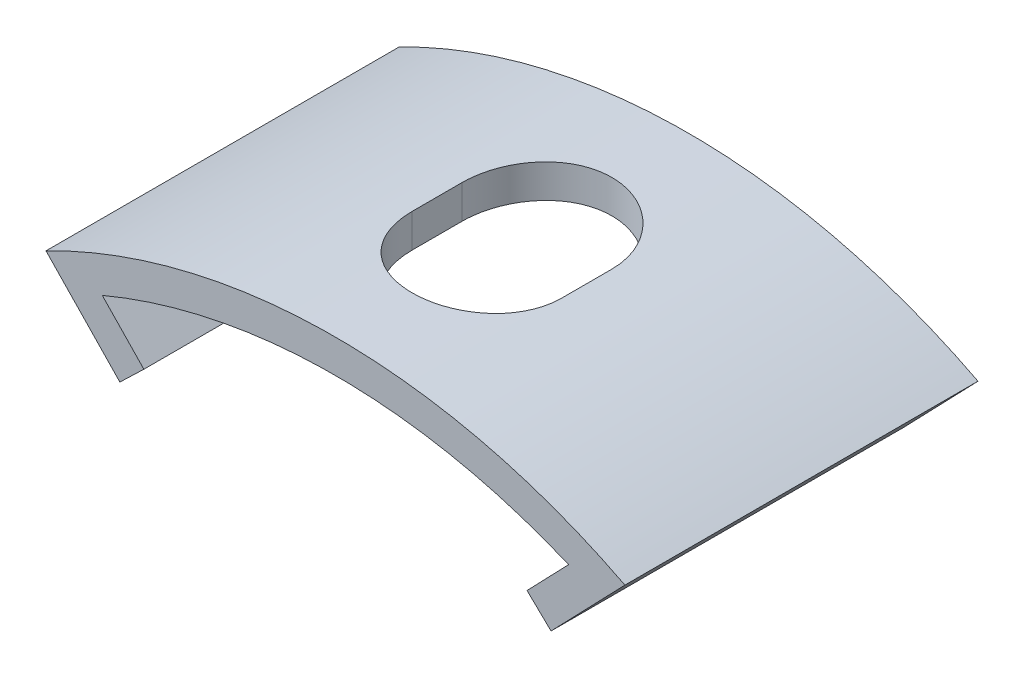
ISO-10303-21;
HEADER;
FILE_DESCRIPTION(('STEP AP214'),'2;1');
FILE_NAME('part.step','',(''),(''),'','','');
FILE_SCHEMA(('AUTOMOTIVE_DESIGN { 1 0 10303 214 1 1 1 1 }'));
ENDSEC;
DATA;
#1=APPLICATION_CONTEXT('core data for automotive mechanical design processes');
#2=APPLICATION_PROTOCOL_DEFINITION('international standard','automotive_design',2000,#1);
#3=PRODUCT_CONTEXT('',#1,'mechanical');
#4=PRODUCT('Part','Part','',(#3));
#5=PRODUCT_RELATED_PRODUCT_CATEGORY('part','',(#4));
#6=PRODUCT_DEFINITION_FORMATION('','',#4);
#7=PRODUCT_DEFINITION_CONTEXT('part definition',#1,'design');
#8=PRODUCT_DEFINITION('design','',#6,#7);
#9=PRODUCT_DEFINITION_SHAPE('','',#8);
#10=(LENGTH_UNIT() NAMED_UNIT(*) SI_UNIT(.MILLI.,.METRE.));
#11=(NAMED_UNIT(*) PLANE_ANGLE_UNIT() SI_UNIT($,.RADIAN.));
#12=(NAMED_UNIT(*) SI_UNIT($,.STERADIAN.) SOLID_ANGLE_UNIT());
#13=UNCERTAINTY_MEASURE_WITH_UNIT(LENGTH_MEASURE(1.E-05),#10,'distance_accuracy_value','');
#14=(GEOMETRIC_REPRESENTATION_CONTEXT(3) GLOBAL_UNCERTAINTY_ASSIGNED_CONTEXT((#13)) GLOBAL_UNIT_ASSIGNED_CONTEXT((#10,
#11,#12)) REPRESENTATION_CONTEXT('',''));
#15=CARTESIAN_POINT('',(0.,0.,0.));
#16=DIRECTION('',(0.,0.,1.));
#17=DIRECTION('',(1.,0.,0.));
#18=AXIS2_PLACEMENT_3D('',#15,#16,#17);
#19=CARTESIAN_POINT('',(0.,0.,5.3));
#20=DIRECTION('',(0.,0.,-1.));
#21=DIRECTION('',(-1.,0.,0.));
#22=AXIS2_PLACEMENT_3D('',#19,#20,#21);
#23=CYLINDRICAL_SURFACE('',#22,18.);
#24=CARTESIAN_POINT('',(0.,0.,-5.3));
#25=DIRECTION('',(0.,0.,1.));
#26=DIRECTION('',(1.,0.,0.));
#27=AXIS2_PLACEMENT_3D('',#24,#25,#26);
#28=CIRCLE('',#27,18.);
#29=CARTESIAN_POINT('',(7.,16.583123951777,-5.3));
#30=VERTEX_POINT('',#29);
#31=CARTESIAN_POINT('',(-7.,16.583123951777,-5.3));
#32=VERTEX_POINT('',#31);
#33=EDGE_CURVE('E229',#30,#32,#28,.T.);
#34=ORIENTED_EDGE('',*,*,#33,.F.);
#35=DIRECTION('',(0.,0.,-1.));
#36=VECTOR('',#35,1.);
#37=CARTESIAN_POINT('',(7.,16.583123951777,5.3));
#38=LINE('',#37,#36);
#39=CARTESIAN_POINT('',(7.,16.583123951777,5.3));
#40=VERTEX_POINT('',#39);
#41=EDGE_CURVE('E250',#40,#30,#38,.T.);
#42=ORIENTED_EDGE('',*,*,#41,.F.);
#43=CARTESIAN_POINT('',(0.,0.,5.3));
#44=DIRECTION('',(0.,0.,1.));
#45=DIRECTION('',(1.,0.,0.));
#46=AXIS2_PLACEMENT_3D('',#43,#44,#45);
#47=CIRCLE('',#46,18.);
#48=CARTESIAN_POINT('',(-7.,16.583123951777,5.3));
#49=VERTEX_POINT('',#48);
#50=EDGE_CURVE('E264',#40,#49,#47,.T.);
#51=ORIENTED_EDGE('',*,*,#50,.T.);
#52=DIRECTION('',(0.,0.,-1.));
#53=VECTOR('',#52,1.);
#54=CARTESIAN_POINT('',(-7.,16.583123951777,5.3));
#55=LINE('',#54,#53);
#56=EDGE_CURVE('E252',#49,#32,#55,.T.);
#57=ORIENTED_EDGE('',*,*,#56,.T.);
#58=EDGE_LOOP('',(#34,#42,#51,#57));
#59=FACE_BOUND('',#58,.T.);
#60=DIRECTION('',(0.,0.,-1.));
#61=VECTOR('',#60,1.);
#62=CARTESIAN_POINT('',(-2.25,17.858821349686,5.3));
#63=LINE('',#62,#61);
#64=CARTESIAN_POINT('',(-2.25,17.858821349686,-0.75));
#65=VERTEX_POINT('',#64);
#66=CARTESIAN_POINT('',(-2.25,17.858821349686,0.75));
#67=VERTEX_POINT('',#66);
#68=EDGE_CURVE('E177',#65,#67,#63,.F.);
#69=ORIENTED_EDGE('',*,*,#68,.T.);
#70=CARTESIAN_POINT('',(-2.25,17.858821349686,0.75));
#71=CARTESIAN_POINT('',(-2.24999987433453,17.8588194251762,0.813038421910983));
#72=CARTESIAN_POINT('',(-2.24734910280741,17.8591555464734,0.876046400447922));
#73=CARTESIAN_POINT('',(-2.2367760280738,17.860483614898,1.00160662816571));
#74=CARTESIAN_POINT('',(-2.22885413082701,17.8614755115204,1.06415891206719));
#75=CARTESIAN_POINT('',(-2.19726613729562,17.8653995354746,1.25031674039511));
#76=CARTESIAN_POINT('',(-2.16577747401027,17.8692801491553,1.37266760263013));
#77=CARTESIAN_POINT('',(-2.08284998220627,17.8791347069465,1.61029050708662));
#78=CARTESIAN_POINT('',(-2.03140462668968,17.8851093358599,1.72556021905842));
#79=CARTESIAN_POINT('',(-1.9100445468626,17.8984759849888,1.94583988541639));
#80=CARTESIAN_POINT('',(-1.8401312637343,17.9058678945916,2.0508506395056));
#81=CARTESIAN_POINT('',(-1.68341206734406,17.9212816202412,2.24819255503716));
#82=CARTESIAN_POINT('',(-1.59652505875848,17.9293063453518,2.34045906512173));
#83=CARTESIAN_POINT('',(-1.4084881592424,17.9450563047993,2.50915218989586));
#84=CARTESIAN_POINT('',(-1.30733609827826,17.9527814933416,2.58557639023872));
#85=CARTESIAN_POINT('',(-1.09323565451996,17.9670912133723,2.72063635035758));
#86=CARTESIAN_POINT('',(-0.980249611183446,17.9736719143119,2.77921284845707));
#87=CARTESIAN_POINT('',(-0.745954846626403,17.9849184109182,2.87653235189302));
#88=CARTESIAN_POINT('',(-0.624646927843693,17.98958439091,2.9152772664524));
#89=CARTESIAN_POINT('',(-0.377817617303712,17.9964554763961,2.97164252706326));
#90=CARTESIAN_POINT('',(-0.252321524361256,17.9986733000917,2.98937208399253));
#91=CARTESIAN_POINT('',(-0.000113958053788392,18.0004416380206,3.00354192890028));
#92=CARTESIAN_POINT('',(0.126597496892533,17.9999921926125,2.9999825390033));
#93=CARTESIAN_POINT('',(0.376889084753837,17.996486825208,2.97176228226685));
#94=CARTESIAN_POINT('',(0.500482760825345,17.9934454852649,2.94721946613686));
#95=CARTESIAN_POINT('',(0.741782589261214,17.9851144748259,2.87791368788275));
#96=CARTESIAN_POINT('',(0.859488661703709,17.9798247738188,2.83315045135721));
#97=CARTESIAN_POINT('',(1.08604033017171,17.9675661901284,2.72454804183679));
#98=CARTESIAN_POINT('',(1.19486100591024,17.9605927880744,2.66065741466114));
#99=CARTESIAN_POINT('',(1.40027581309508,17.9457473888532,2.51565390113486));
#100=CARTESIAN_POINT('',(1.49686990014344,17.9378753884233,2.43454095224834));
#101=CARTESIAN_POINT('',(1.67577600776006,17.9220509715218,2.25674697940169));
#102=CARTESIAN_POINT('',(1.75798787566357,17.9140983698413,2.15996517270914));
#103=CARTESIAN_POINT('',(1.90504051240019,17.8990587520914,1.95388697055325));
#104=CARTESIAN_POINT('',(1.96987611791605,17.8919719936451,1.84458686904738));
#105=CARTESIAN_POINT('',(2.08034030367041,17.8794655923308,1.61647074802186));
#106=CARTESIAN_POINT('',(2.12594942241975,17.8740476401532,1.49764523072224));
#107=CARTESIAN_POINT('',(2.19647134414845,17.8655197697751,1.25402518960859));
#108=CARTESIAN_POINT('',(2.22141531410094,17.8624063766198,1.12923995593975));
#109=CARTESIAN_POINT('',(2.24045955676342,17.860021010604,0.961297341119165));
#110=CARTESIAN_POINT('',(2.24403891993201,17.8595714574598,0.919080958189035));
#111=CARTESIAN_POINT('',(2.24880594188023,17.8589719767877,0.834582343684646));
#112=CARTESIAN_POINT('',(2.2499976086946,17.8588215471485,0.792300341894064));
#113=CARTESIAN_POINT('',(2.25,17.858821349686,0.75));
#114=B_SPLINE_CURVE_WITH_KNOTS('',3,(#70,#71,#72,#73,#74,#75,#76,#77,#78,#79,#80,#81,#82,#83,
#84,#85,#86,#87,#88,#89,#90,#91,#92,#93,#94,#95,#96,#97,#98,#99,#100,#101,#102,#103,#104,#105,
#106,#107,#108,#109,#110,#111,#112,#113),.UNSPECIFIED.,.F.,.F.,(4,2,2,2,2,2,2,2,2,2,2,2,2,2,2,2,
2,2,2,2,2,4),(0.,0.188998328147948,0.377982102132345,0.755226013918386,1.13259341054784,
1.50993136724195,1.88911828117894,2.2683629402761,2.6488534582724,3.02930733885574,
3.40777531688837,3.78623756831039,4.16258453387273,4.53893660680898,4.91631033520017,
5.29368543389454,5.6735920154572,6.05361136055525,6.43401445159375,6.81384277259916,
6.94090357256708,7.06775090645285),.UNSPECIFIED.);
#115=CARTESIAN_POINT('',(2.25,17.858821349686,0.75));
#116=VERTEX_POINT('',#115);
#117=EDGE_CURVE('E142',#67,#116,#114,.T.);
#118=ORIENTED_EDGE('',*,*,#117,.T.);
#119=DIRECTION('',(0.,0.,-1.));
#120=VECTOR('',#119,1.);
#121=CARTESIAN_POINT('',(2.25,17.858821349686,5.3));
#122=LINE('',#121,#120);
#123=CARTESIAN_POINT('',(2.25,17.858821349686,-0.75));
#124=VERTEX_POINT('',#123);
#125=EDGE_CURVE('E176',#116,#124,#122,.T.);
#126=ORIENTED_EDGE('',*,*,#125,.T.);
#127=CARTESIAN_POINT('',(2.25,17.858821349686,-0.75));
#128=CARTESIAN_POINT('',(2.24999987433453,17.8588194251762,-0.813038421910983));
#129=CARTESIAN_POINT('',(2.24734910280741,17.8591555464734,-0.876046400447922));
#130=CARTESIAN_POINT('',(2.2367760280738,17.860483614898,-1.00160662816571));
#131=CARTESIAN_POINT('',(2.22885413082701,17.8614755115204,-1.06415891206719));
#132=CARTESIAN_POINT('',(2.19726613729562,17.8653995354746,-1.25031674039511));
#133=CARTESIAN_POINT('',(2.16577747401027,17.8692801491553,-1.37266760263013));
#134=CARTESIAN_POINT('',(2.08284998220627,17.8791347069465,-1.61029050708662));
#135=CARTESIAN_POINT('',(2.03140462668968,17.8851093358599,-1.72556021905842));
#136=CARTESIAN_POINT('',(1.91004454686259,17.8984759849888,-1.94583988541639));
#137=CARTESIAN_POINT('',(1.8401312637343,17.9058678945916,-2.0508506395056));
#138=CARTESIAN_POINT('',(1.68341206734406,17.9212816202412,-2.24819255503716));
#139=CARTESIAN_POINT('',(1.59652505875848,17.9293063453518,-2.34045906512173));
#140=CARTESIAN_POINT('',(1.4084881592424,17.9450563047993,-2.50915218989586));
#141=CARTESIAN_POINT('',(1.30733609827826,17.9527814933416,-2.58557639023872));
#142=CARTESIAN_POINT('',(1.09323565451996,17.9670912133723,-2.72063635035758));
#143=CARTESIAN_POINT('',(0.980249611183446,17.9736719143119,-2.77921284845707));
#144=CARTESIAN_POINT('',(0.745954846626401,17.9849184109182,-2.87653235189302));
#145=CARTESIAN_POINT('',(0.624646927843692,17.98958439091,-2.9152772664524));
#146=CARTESIAN_POINT('',(0.377817617303711,17.9964554763961,-2.97164252706327));
#147=CARTESIAN_POINT('',(0.252321524361255,17.9986733000917,-2.98937208399253));
#148=CARTESIAN_POINT('',(0.000113958053786956,18.0004416380206,-3.00354192890028));
#149=CARTESIAN_POINT('',(-0.126597496892535,17.9999921926125,-2.9999825390033));
#150=CARTESIAN_POINT('',(-0.376889084753838,17.996486825208,-2.97176228226685));
#151=CARTESIAN_POINT('',(-0.500482760825348,17.9934454852649,-2.94721946613686));
#152=CARTESIAN_POINT('',(-0.741782589261217,17.9851144748259,-2.87791368788275));
#153=CARTESIAN_POINT('',(-0.859488661703711,17.9798247738188,-2.83315045135721));
#154=CARTESIAN_POINT('',(-1.08604033017171,17.9675661901284,-2.72454804183679));
#155=CARTESIAN_POINT('',(-1.19486100591024,17.9605927880744,-2.66065741466114));
#156=CARTESIAN_POINT('',(-1.40027581309508,17.9457473888532,-2.51565390113486));
#157=CARTESIAN_POINT('',(-1.49686990014345,17.9378753884233,-2.43454095224834));
#158=CARTESIAN_POINT('',(-1.67577600776006,17.9220509715218,-2.25674697940169));
#159=CARTESIAN_POINT('',(-1.75798787566357,17.9140983698413,-2.15996517270914));
#160=CARTESIAN_POINT('',(-1.90504051240019,17.8990587520914,-1.95388697055325));
#161=CARTESIAN_POINT('',(-1.96987611791605,17.8919719936451,-1.84458686904739));
#162=CARTESIAN_POINT('',(-2.08034030367041,17.8794655923308,-1.61647074802187));
#163=CARTESIAN_POINT('',(-2.12594942241975,17.8740476401532,-1.49764523072224));
#164=CARTESIAN_POINT('',(-2.19647134414845,17.8655197697751,-1.25402518960859));
#165=CARTESIAN_POINT('',(-2.22141531410094,17.8624063766198,-1.12923995593975));
#166=CARTESIAN_POINT('',(-2.24045955676343,17.860021010604,-0.961297341119165));
#167=CARTESIAN_POINT('',(-2.24403891993201,17.8595714574598,-0.919080958189035));
#168=CARTESIAN_POINT('',(-2.24880594188023,17.8589719767877,-0.834582343684645));
#169=CARTESIAN_POINT('',(-2.24999760869461,17.8588215471485,-0.792300341894064));
#170=CARTESIAN_POINT('',(-2.25,17.858821349686,-0.749999999999999));
#171=B_SPLINE_CURVE_WITH_KNOTS('',3,(#127,#128,#129,#130,#131,#132,#133,#134,#135,#136,#137,
#138,#139,#140,#141,#142,#143,#144,#145,#146,#147,#148,#149,#150,#151,#152,#153,#154,#155,#156,
#157,#158,#159,#160,#161,#162,#163,#164,#165,#166,#167,#168,#169,#170),.UNSPECIFIED.,.F.,.F.,(4,
2,2,2,2,2,2,2,2,2,2,2,2,2,2,2,2,2,2,2,2,4),(0.,0.188998328147948,0.377982102132345,
0.755226013918386,1.13259341054784,1.50993136724195,1.88911828117894,2.2683629402761,
2.6488534582724,3.02930733885574,3.40777531688837,3.78623756831039,4.16258453387273,
4.53893660680899,4.91631033520017,5.29368543389454,5.6735920154572,6.05361136055525,
6.43401445159375,6.81384277259917,6.94090357256708,7.06775090645286),.UNSPECIFIED.);
#172=EDGE_CURVE('E168',#124,#65,#171,.T.);
#173=ORIENTED_EDGE('',*,*,#172,.T.);
#174=EDGE_LOOP('',(#69,#118,#126,#173));
#175=FACE_BOUND('',#174,.T.);
#176=ADVANCED_FACE('F39',(#59,#175),#23,.F.);
#177=CARTESIAN_POINT('',(0.,0.,5.3));
#178=DIRECTION('',(0.,0.,-1.));
#179=DIRECTION('',(-1.,0.,0.));
#180=AXIS2_PLACEMENT_3D('',#177,#178,#179);
#181=CYLINDRICAL_SURFACE('',#180,19.);
#182=CARTESIAN_POINT('',(0.,0.,-5.3));
#183=DIRECTION('',(0.,0.,1.));
#184=DIRECTION('',(1.,0.,0.));
#185=AXIS2_PLACEMENT_3D('',#182,#183,#184);
#186=CIRCLE('',#185,19.);
#187=CARTESIAN_POINT('',(8.68969024076547,16.896428129032,-5.3));
#188=VERTEX_POINT('',#187);
#189=CARTESIAN_POINT('',(-8.68969024076547,16.896428129032,-5.3));
#190=VERTEX_POINT('',#189);
#191=EDGE_CURVE('E214',#188,#190,#186,.T.);
#192=ORIENTED_EDGE('',*,*,#191,.T.);
#193=DIRECTION('',(0.,0.,-1.));
#194=VECTOR('',#193,1.);
#195=CARTESIAN_POINT('',(-8.68969024076547,16.896428129032,5.3));
#196=LINE('',#195,#194);
#197=CARTESIAN_POINT('',(-8.68969024076547,16.896428129032,5.3));
#198=VERTEX_POINT('',#197);
#199=EDGE_CURVE('E241',#198,#190,#196,.T.);
#200=ORIENTED_EDGE('',*,*,#199,.F.);
#201=CARTESIAN_POINT('',(0.,0.,5.3));
#202=DIRECTION('',(0.,0.,1.));
#203=DIRECTION('',(1.,0.,0.));
#204=AXIS2_PLACEMENT_3D('',#201,#202,#203);
#205=CIRCLE('',#204,19.);
#206=CARTESIAN_POINT('',(8.68969024076547,16.896428129032,5.3));
#207=VERTEX_POINT('',#206);
#208=EDGE_CURVE('E225',#207,#198,#205,.T.);
#209=ORIENTED_EDGE('',*,*,#208,.F.);
#210=DIRECTION('',(0.,0.,-1.));
#211=VECTOR('',#210,1.);
#212=CARTESIAN_POINT('',(8.68969024076547,16.896428129032,5.3));
#213=LINE('',#212,#211);
#214=EDGE_CURVE('E243',#207,#188,#213,.T.);
#215=ORIENTED_EDGE('',*,*,#214,.T.);
#216=EDGE_LOOP('',(#192,#200,#209,#215));
#217=FACE_BOUND('',#216,.T.);
#218=CARTESIAN_POINT('',(-2.25,18.8663059447259,0.75));
#219=CARTESIAN_POINT('',(-2.24999984413377,18.866304126766,0.813065444008957));
#220=CARTESIAN_POINT('',(-2.24734683038286,18.8666225662772,0.876100456864434));
#221=CARTESIAN_POINT('',(-2.23676461239271,18.8678808036718,1.00171506453087));
#222=CARTESIAN_POINT('',(-2.22883579857183,18.8688205555769,1.06429469269468));
#223=CARTESIAN_POINT('',(-2.19721906511498,18.8725384514377,1.25053881791379));
#224=CARTESIAN_POINT('',(-2.16570059497972,18.876215376971,1.37294884829296));
#225=CARTESIAN_POINT('',(-2.08268940200505,18.8855534165936,1.61068939978139));
#226=CARTESIAN_POINT('',(-2.0311898629049,18.8912152077282,1.72601748941873));
#227=CARTESIAN_POINT('',(-1.9096974928355,18.9038824486064,1.94640209506089));
#228=CARTESIAN_POINT('',(-1.83970632808281,18.9108877772729,2.05145953535055));
#229=CARTESIAN_POINT('',(-1.68285058840054,18.9254914459535,2.2488249331985));
#230=CARTESIAN_POINT('',(-1.59591314397453,18.9330922589904,2.34107477466332));
#231=CARTESIAN_POINT('',(-1.40777799267168,18.9480090918228,2.50972207917964));
#232=CARTESIAN_POINT('',(-1.3065781169975,18.9553250680887,2.5861171269167));
#233=CARTESIAN_POINT('',(-1.09242950974802,18.9688725160587,2.72108165180554));
#234=CARTESIAN_POINT('',(-0.979447124621018,18.975100737433,2.77959808332987));
#235=CARTESIAN_POINT('',(-0.745179993513777,18.985743053388,2.87680195802174));
#236=CARTESIAN_POINT('',(-0.623896020192753,18.9901573165335,2.91549124373732));
#237=CARTESIAN_POINT('',(-0.377065646956689,18.9966571872975,2.97177169513252));
#238=CARTESIAN_POINT('',(-0.251541895868488,18.9987536150932,2.98946092262533));
#239=CARTESIAN_POINT('',(0.000711970235301823,19.0004185383706,3.00354301109507));
#240=CARTESIAN_POINT('',(0.127442071650238,18.9999870623187,2.99993611188586));
#241=CARTESIAN_POINT('',(0.377837656700778,18.9966534829824,2.9716064392706));
#242=CARTESIAN_POINT('',(0.501515328123363,18.9937637890536,2.94698972369523));
#243=CARTESIAN_POINT('',(0.742970891810421,18.9858525077212,2.87750493446024));
#244=CARTESIAN_POINT('',(0.860748713087663,18.9808308946732,2.83263661719752));
#245=CARTESIAN_POINT('',(1.08739417162659,18.9691986105771,2.72380756445231));
#246=CARTESIAN_POINT('',(1.19623924436736,18.9625840719268,2.65980026694911));
#247=CARTESIAN_POINT('',(1.4016780442815,18.9485069935124,2.51454671739229));
#248=CARTESIAN_POINT('',(1.49827179267252,18.9410444552171,2.43330049519482));
#249=CARTESIAN_POINT('',(1.67708146493049,18.9260538253829,2.25529359456109));
#250=CARTESIAN_POINT('',(1.75920752476244,18.9185256093612,2.15844264223406));
#251=CARTESIAN_POINT('',(1.90607611238423,18.9042941674795,1.95224612854428));
#252=CARTESIAN_POINT('',(1.97081344036131,18.8975911887167,1.84289684366567));
#253=CARTESIAN_POINT('',(2.08106902250753,18.8857682243098,1.61471612700434));
#254=CARTESIAN_POINT('',(2.12656907316942,18.8806497392327,1.49587584007561));
#255=CARTESIAN_POINT('',(2.19687527764837,18.872599510043,1.25225438931704));
#256=CARTESIAN_POINT('',(2.22171263247485,18.8696644696046,1.12748248463915));
#257=CARTESIAN_POINT('',(2.2405901012447,18.8674260294376,0.959849720419371));
#258=CARTESIAN_POINT('',(2.24412051000476,18.8670062867246,0.917921350010672));
#259=CARTESIAN_POINT('',(2.24882229454311,18.8664465763562,0.834001213167836));
#260=CARTESIAN_POINT('',(2.24999761940603,18.8663061403527,0.792009671218649));
#261=CARTESIAN_POINT('',(2.25,18.8663059447259,0.75));
#262=B_SPLINE_CURVE_WITH_KNOTS('',3,(#218,#219,#220,#221,#222,#223,#224,#225,#226,#227,#228,
#229,#230,#231,#232,#233,#234,#235,#236,#237,#238,#239,#240,#241,#242,#243,#244,#245,#246,#247,
#248,#249,#250,#251,#252,#253,#254,#255,#256,#257,#258,#259,#260,#261),.UNSPECIFIED.,.F.,.F.,(4,
2,2,2,2,2,2,2,2,2,2,2,2,2,2,2,2,2,2,2,2,4),(0.,0.189079425503063,0.378144860356892,
0.755564078222733,1.13311216071341,1.510626235245,1.88980094259794,2.26903337097799,
2.64938028868305,3.02969185411809,3.40822044347497,3.7867447702622,4.16336952684837,
4.53999881391062,4.91755193870435,5.29510440961777,5.67492510427658,6.05485925190686,
6.4351521165356,6.81486968499599,6.94105757499129,7.06703369118151),.UNSPECIFIED.);
#263=CARTESIAN_POINT('',(-2.25,18.8663059447259,0.75));
#264=VERTEX_POINT('',#263);
#265=CARTESIAN_POINT('',(2.25,18.8663059447259,0.75));
#266=VERTEX_POINT('',#265);
#267=EDGE_CURVE('E11',#264,#266,#262,.T.);
#268=ORIENTED_EDGE('',*,*,#267,.F.);
#269=DIRECTION('',(0.,0.,-1.));
#270=VECTOR('',#269,1.);
#271=CARTESIAN_POINT('',(-2.25,18.8663059447259,5.3));
#272=LINE('',#271,#270);
#273=CARTESIAN_POINT('',(-2.25,18.8663059447259,-0.750000000000001));
#274=VERTEX_POINT('',#273);
#275=EDGE_CURVE('E129',#274,#264,#272,.F.);
#276=ORIENTED_EDGE('',*,*,#275,.F.);
#277=CARTESIAN_POINT('',(2.25,18.8663059447259,-0.75));
#278=CARTESIAN_POINT('',(2.24999984413377,18.866304126766,-0.813065444008957));
#279=CARTESIAN_POINT('',(2.24734683038285,18.8666225662772,-0.876100456864433));
#280=CARTESIAN_POINT('',(2.23676461239271,18.8678808036718,-1.00171506453087));
#281=CARTESIAN_POINT('',(2.22883579857183,18.8688205555769,-1.06429469269468));
#282=CARTESIAN_POINT('',(2.19721906511497,18.8725384514377,-1.25053881791379));
#283=CARTESIAN_POINT('',(2.16570059497971,18.876215376971,-1.37294884829296));
#284=CARTESIAN_POINT('',(2.08268940200505,18.8855534165936,-1.61068939978139));
#285=CARTESIAN_POINT('',(2.0311898629049,18.8912152077282,-1.72601748941873));
#286=CARTESIAN_POINT('',(1.9096974928355,18.9038824486064,-1.94640209506089));
#287=CARTESIAN_POINT('',(1.8397063280828,18.9108877772729,-2.05145953535055));
#288=CARTESIAN_POINT('',(1.68285058840054,18.9254914459535,-2.2488249331985));
#289=CARTESIAN_POINT('',(1.59591314397453,18.9330922589904,-2.34107477466332));
#290=CARTESIAN_POINT('',(1.40777799267168,18.9480090918228,-2.50972207917964));
#291=CARTESIAN_POINT('',(1.30657811699749,18.9553250680887,-2.5861171269167));
#292=CARTESIAN_POINT('',(1.09242950974802,18.9688725160587,-2.72108165180554));
#293=CARTESIAN_POINT('',(0.979447124621017,18.975100737433,-2.77959808332987));
#294=CARTESIAN_POINT('',(0.745179993513776,18.985743053388,-2.87680195802174));
#295=CARTESIAN_POINT('',(0.623896020192752,18.9901573165335,-2.91549124373732));
#296=CARTESIAN_POINT('',(0.377065646956688,18.9966571872975,-2.97177169513252));
#297=CARTESIAN_POINT('',(0.251541895868486,18.9987536150932,-2.98946092262533));
#298=CARTESIAN_POINT('',(-0.000711970235303124,19.0004185383706,-3.00354301109507));
#299=CARTESIAN_POINT('',(-0.127442071650239,18.9999870623187,-2.99993611188586));
#300=CARTESIAN_POINT('',(-0.377837656700779,18.9966534829824,-2.9716064392706));
#301=CARTESIAN_POINT('',(-0.501515328123365,18.9937637890536,-2.94698972369523));
#302=CARTESIAN_POINT('',(-0.742970891810423,18.9858525077212,-2.87750493446024));
#303=CARTESIAN_POINT('',(-0.860748713087664,18.9808308946732,-2.83263661719752));
#304=CARTESIAN_POINT('',(-1.08739417162659,18.9691986105771,-2.72380756445231));
#305=CARTESIAN_POINT('',(-1.19623924436736,18.9625840719268,-2.65980026694912));
#306=CARTESIAN_POINT('',(-1.4016780442815,18.9485069935124,-2.51454671739229));
#307=CARTESIAN_POINT('',(-1.49827179267252,18.9410444552171,-2.43330049519482));
#308=CARTESIAN_POINT('',(-1.67708146493049,18.9260538253829,-2.25529359456109));
#309=CARTESIAN_POINT('',(-1.75920752476244,18.9185256093612,-2.15844264223406));
#310=CARTESIAN_POINT('',(-1.90607611238423,18.9042941674794,-1.95224612854428));
#311=CARTESIAN_POINT('',(-1.97081344036131,18.8975911887167,-1.84289684366567));
#312=CARTESIAN_POINT('',(-2.08106902250753,18.8857682243098,-1.61471612700434));
#313=CARTESIAN_POINT('',(-2.12656907316942,18.8806497392328,-1.49587584007561));
#314=CARTESIAN_POINT('',(-2.19687527764837,18.872599510043,-1.25225438931704));
#315=CARTESIAN_POINT('',(-2.22171263247485,18.8696644696046,-1.12748248463915));
#316=CARTESIAN_POINT('',(-2.24059010124471,18.8674260294376,-0.959849720419372));
#317=CARTESIAN_POINT('',(-2.24412051000476,18.8670062867246,-0.917921350010673));
#318=CARTESIAN_POINT('',(-2.24882229454311,18.8664465763562,-0.834001213167836));
#319=CARTESIAN_POINT('',(-2.24999761940603,18.8663061403527,-0.792009671218648));
#320=CARTESIAN_POINT('',(-2.25,18.8663059447259,-0.749999999999999));
#321=B_SPLINE_CURVE_WITH_KNOTS('',3,(#277,#278,#279,#280,#281,#282,#283,#284,#285,#286,#287,
#288,#289,#290,#291,#292,#293,#294,#295,#296,#297,#298,#299,#300,#301,#302,#303,#304,#305,#306,
#307,#308,#309,#310,#311,#312,#313,#314,#315,#316,#317,#318,#319,#320),.UNSPECIFIED.,.F.,.F.,(4,
2,2,2,2,2,2,2,2,2,2,2,2,2,2,2,2,2,2,2,2,4),(0.,0.189079425503062,0.378144860356892,
0.755564078222733,1.13311216071341,1.510626235245,1.88980094259794,2.26903337097799,
2.64938028868305,3.02969185411809,3.40822044347497,3.7867447702622,4.16336952684837,
4.53999881391062,4.91755193870435,5.29510440961777,5.67492510427658,6.05485925190686,
6.4351521165356,6.814869684996,6.9410575749913,7.06703369118151),.UNSPECIFIED.);
#322=CARTESIAN_POINT('',(2.25,18.8663059447259,-0.75));
#323=VERTEX_POINT('',#322);
#324=EDGE_CURVE('E134',#323,#274,#321,.T.);
#325=ORIENTED_EDGE('',*,*,#324,.F.);
#326=DIRECTION('',(0.,0.,-1.));
#327=VECTOR('',#326,1.);
#328=CARTESIAN_POINT('',(2.25,18.8663059447259,5.3));
#329=LINE('',#328,#327);
#330=EDGE_CURVE('E52',#266,#323,#329,.T.);
#331=ORIENTED_EDGE('',*,*,#330,.F.);
#332=EDGE_LOOP('',(#268,#276,#325,#331));
#333=FACE_BOUND('',#332,.T.);
#334=ADVANCED_FACE('F146',(#217,#333),#181,.T.);
#335=CARTESIAN_POINT('',(-7.72042085561147,15.889586792859,5.3));
#336=DIRECTION('',(0.720420855611469,0.693537158917991,0.));
#337=DIRECTION('',(-0.693537158917991,0.720420855611469,0.));
#338=AXIS2_PLACEMENT_3D('',#335,#336,#337);
#339=PLANE('',#338);
#340=DIRECTION('',(0.693537158917991,-0.720420855611469,0.));
#341=VECTOR('',#340,1.);
#342=CARTESIAN_POINT('',(-7.72042085561147,15.889586792859,-5.3));
#343=LINE('',#342,#341);
#344=CARTESIAN_POINT('',(-6.47205396955908,14.5928292527584,-5.3));
#345=VERTEX_POINT('',#344);
#346=EDGE_CURVE('E193',#190,#345,#343,.T.);
#347=ORIENTED_EDGE('',*,*,#346,.T.);
#348=DIRECTION('',(0.,0.,-1.));
#349=VECTOR('',#348,1.);
#350=CARTESIAN_POINT('',(-6.47205396955908,14.5928292527584,5.3));
#351=LINE('',#350,#349);
#352=CARTESIAN_POINT('',(-6.47205396955908,14.5928292527584,5.3));
#353=VERTEX_POINT('',#352);
#354=EDGE_CURVE('E135',#353,#345,#351,.T.);
#355=ORIENTED_EDGE('',*,*,#354,.F.);
#356=DIRECTION('',(0.693537158917991,-0.720420855611469,0.));
#357=VECTOR('',#356,1.);
#358=CARTESIAN_POINT('',(-7.72042085561147,15.889586792859,5.3));
#359=LINE('',#358,#357);
#360=EDGE_CURVE('E194',#198,#353,#359,.T.);
#361=ORIENTED_EDGE('',*,*,#360,.F.);
#362=ORIENTED_EDGE('',*,*,#199,.T.);
#363=EDGE_LOOP('',(#347,#355,#361,#362));
#364=FACE_BOUND('',#363,.T.);
#365=ADVANCED_FACE('F41',(#364),#339,.F.);
#366=CARTESIAN_POINT('',(-5.75163311394761,15.2863664116764,5.3));
#367=DIRECTION('',(0.693537158917991,-0.720420855611469,0.));
#368=DIRECTION('',(0.720420855611469,0.693537158917991,0.));
#369=AXIS2_PLACEMENT_3D('',#366,#367,#368);
#370=PLANE('',#369);
#371=DIRECTION('',(-0.720420855611469,-0.693537158917991,0.));
#372=VECTOR('',#371,1.);
#373=CARTESIAN_POINT('',(-5.75163311394761,15.2863664116764,-5.3));
#374=LINE('',#373,#372);
#375=CARTESIAN_POINT('',(-5.75163311394761,15.2863664116764,-5.3));
#376=VERTEX_POINT('',#375);
#377=EDGE_CURVE('E217',#376,#345,#374,.T.);
#378=ORIENTED_EDGE('',*,*,#377,.F.);
#379=DIRECTION('',(0.,0.,-1.));
#380=VECTOR('',#379,1.);
#381=CARTESIAN_POINT('',(-5.75163311394761,15.2863664116764,5.3));
#382=LINE('',#381,#380);
#383=CARTESIAN_POINT('',(-5.75163311394761,15.2863664116764,5.3));
#384=VERTEX_POINT('',#383);
#385=EDGE_CURVE('E254',#384,#376,#382,.T.);
#386=ORIENTED_EDGE('',*,*,#385,.F.);
#387=DIRECTION('',(-0.720420855611469,-0.693537158917991,0.));
#388=VECTOR('',#387,1.);
#389=CARTESIAN_POINT('',(-5.75163311394761,15.2863664116764,5.3));
#390=LINE('',#389,#388);
#391=EDGE_CURVE('E259',#384,#353,#390,.T.);
#392=ORIENTED_EDGE('',*,*,#391,.T.);
#393=ORIENTED_EDGE('',*,*,#354,.T.);
#394=EDGE_LOOP('',(#378,#386,#392,#393));
#395=FACE_BOUND('',#394,.T.);
#396=ADVANCED_FACE('F257',(#395),#370,.T.);
#397=CARTESIAN_POINT('',(-7.,16.583123951777,5.3));
#398=DIRECTION('',(0.720420855611469,0.693537158917991,0.));
#399=DIRECTION('',(-0.693537158917991,0.720420855611469,0.));
#400=AXIS2_PLACEMENT_3D('',#397,#398,#399);
#401=PLANE('',#400);
#402=DIRECTION('',(0.693537158917991,-0.720420855611469,0.));
#403=VECTOR('',#402,1.);
#404=CARTESIAN_POINT('',(-7.,16.583123951777,-5.3));
#405=LINE('',#404,#403);
#406=EDGE_CURVE('E222',#32,#376,#405,.T.);
#407=ORIENTED_EDGE('',*,*,#406,.F.);
#408=ORIENTED_EDGE('',*,*,#56,.F.);
#409=DIRECTION('',(0.693537158917991,-0.720420855611469,0.));
#410=VECTOR('',#409,1.);
#411=CARTESIAN_POINT('',(-7.,16.583123951777,5.3));
#412=LINE('',#411,#410);
#413=EDGE_CURVE('E262',#49,#384,#412,.T.);
#414=ORIENTED_EDGE('',*,*,#413,.T.);
#415=ORIENTED_EDGE('',*,*,#385,.T.);
#416=EDGE_LOOP('',(#407,#408,#414,#415));
#417=FACE_BOUND('',#416,.T.);
#418=ADVANCED_FACE('F187',(#417),#401,.T.);
#419=CARTESIAN_POINT('',(7.,16.583123951777,5.3));
#420=DIRECTION('',(-0.720420855611469,0.693537158917991,0.));
#421=DIRECTION('',(-0.693537158917991,-0.720420855611469,0.));
#422=AXIS2_PLACEMENT_3D('',#419,#420,#421);
#423=PLANE('',#422);
#424=DIRECTION('',(0.693537158917991,0.720420855611469,0.));
#425=VECTOR('',#424,1.);
#426=CARTESIAN_POINT('',(7.,16.583123951777,-5.3));
#427=LINE('',#426,#425);
#428=CARTESIAN_POINT('',(5.75163311394762,15.2863664116764,-5.3));
#429=VERTEX_POINT('',#428);
#430=EDGE_CURVE('E232',#429,#30,#427,.T.);
#431=ORIENTED_EDGE('',*,*,#430,.F.);
#432=DIRECTION('',(0.,0.,-1.));
#433=VECTOR('',#432,1.);
#434=CARTESIAN_POINT('',(5.75163311394762,15.2863664116764,5.3));
#435=LINE('',#434,#433);
#436=CARTESIAN_POINT('',(5.75163311394762,15.2863664116764,5.3));
#437=VERTEX_POINT('',#436);
#438=EDGE_CURVE('E248',#437,#429,#435,.T.);
#439=ORIENTED_EDGE('',*,*,#438,.F.);
#440=DIRECTION('',(0.693537158917991,0.720420855611469,0.));
#441=VECTOR('',#440,1.);
#442=CARTESIAN_POINT('',(7.,16.583123951777,5.3));
#443=LINE('',#442,#441);
#444=EDGE_CURVE('E269',#437,#40,#443,.T.);
#445=ORIENTED_EDGE('',*,*,#444,.T.);
#446=ORIENTED_EDGE('',*,*,#41,.T.);
#447=EDGE_LOOP('',(#431,#439,#445,#446));
#448=FACE_BOUND('',#447,.T.);
#449=ADVANCED_FACE('F185',(#448),#423,.T.);
#450=CARTESIAN_POINT('',(6.47205396955909,14.5928292527584,5.3));
#451=DIRECTION('',(-0.693537158917991,-0.720420855611469,0.));
#452=DIRECTION('',(0.720420855611469,-0.693537158917991,0.));
#453=AXIS2_PLACEMENT_3D('',#450,#451,#452);
#454=PLANE('',#453);
#455=DIRECTION('',(-0.720420855611469,0.693537158917991,0.));
#456=VECTOR('',#455,1.);
#457=CARTESIAN_POINT('',(6.47205396955909,14.5928292527584,-5.3));
#458=LINE('',#457,#456);
#459=CARTESIAN_POINT('',(6.47205396955909,14.5928292527584,-5.3));
#460=VERTEX_POINT('',#459);
#461=EDGE_CURVE('E235',#460,#429,#458,.T.);
#462=ORIENTED_EDGE('',*,*,#461,.F.);
#463=DIRECTION('',(0.,0.,-1.));
#464=VECTOR('',#463,1.);
#465=CARTESIAN_POINT('',(6.47205396955909,14.5928292527584,5.3));
#466=LINE('',#465,#464);
#467=CARTESIAN_POINT('',(6.47205396955909,14.5928292527584,5.3));
#468=VERTEX_POINT('',#467);
#469=EDGE_CURVE('E246',#468,#460,#466,.T.);
#470=ORIENTED_EDGE('',*,*,#469,.F.);
#471=DIRECTION('',(-0.720420855611469,0.693537158917991,0.));
#472=VECTOR('',#471,1.);
#473=CARTESIAN_POINT('',(6.47205396955909,14.5928292527584,5.3));
#474=LINE('',#473,#472);
#475=EDGE_CURVE('E272',#468,#437,#474,.T.);
#476=ORIENTED_EDGE('',*,*,#475,.T.);
#477=ORIENTED_EDGE('',*,*,#438,.T.);
#478=EDGE_LOOP('',(#462,#470,#476,#477));
#479=FACE_BOUND('',#478,.T.);
#480=ADVANCED_FACE('F283',(#479),#454,.T.);
#481=CARTESIAN_POINT('',(7.72042085561147,15.889586792859,5.3));
#482=DIRECTION('',(-0.720420855611469,0.693537158917991,0.));
#483=DIRECTION('',(-0.693537158917991,-0.720420855611469,0.));
#484=AXIS2_PLACEMENT_3D('',#481,#482,#483);
#485=PLANE('',#484);
#486=DIRECTION('',(0.693537158917991,0.720420855611469,0.));
#487=VECTOR('',#486,1.);
#488=CARTESIAN_POINT('',(7.72042085561147,15.889586792859,-5.3));
#489=LINE('',#488,#487);
#490=EDGE_CURVE('E238',#460,#188,#489,.T.);
#491=ORIENTED_EDGE('',*,*,#490,.T.);
#492=ORIENTED_EDGE('',*,*,#214,.F.);
#493=DIRECTION('',(0.693537158917991,0.720420855611469,0.));
#494=VECTOR('',#493,1.);
#495=CARTESIAN_POINT('',(7.72042085561147,15.889586792859,5.3));
#496=LINE('',#495,#494);
#497=EDGE_CURVE('E274',#468,#207,#496,.T.);
#498=ORIENTED_EDGE('',*,*,#497,.F.);
#499=ORIENTED_EDGE('',*,*,#469,.T.);
#500=EDGE_LOOP('',(#491,#492,#498,#499));
#501=FACE_BOUND('',#500,.T.);
#502=ADVANCED_FACE('F203',(#501),#485,.F.);
#503=CARTESIAN_POINT('',(0.,0.,5.3));
#504=DIRECTION('',(0.,0.,1.));
#505=DIRECTION('',(1.,0.,0.));
#506=AXIS2_PLACEMENT_3D('',#503,#504,#505);
#507=PLANE('',#506);
#508=ORIENTED_EDGE('',*,*,#360,.T.);
#509=ORIENTED_EDGE('',*,*,#391,.F.);
#510=ORIENTED_EDGE('',*,*,#413,.F.);
#511=ORIENTED_EDGE('',*,*,#50,.F.);
#512=ORIENTED_EDGE('',*,*,#444,.F.);
#513=ORIENTED_EDGE('',*,*,#475,.F.);
#514=ORIENTED_EDGE('',*,*,#497,.T.);
#515=ORIENTED_EDGE('',*,*,#208,.T.);
#516=EDGE_LOOP('',(#508,#509,#510,#511,#512,#513,#514,#515));
#517=FACE_BOUND('',#516,.T.);
#518=ADVANCED_FACE('F200',(#517),#507,.T.);
#519=CARTESIAN_POINT('',(0.,0.,-5.3));
#520=DIRECTION('',(0.,0.,1.));
#521=DIRECTION('',(1.,0.,0.));
#522=AXIS2_PLACEMENT_3D('',#519,#520,#521);
#523=PLANE('',#522);
#524=ORIENTED_EDGE('',*,*,#346,.F.);
#525=ORIENTED_EDGE('',*,*,#191,.F.);
#526=ORIENTED_EDGE('',*,*,#490,.F.);
#527=ORIENTED_EDGE('',*,*,#461,.T.);
#528=ORIENTED_EDGE('',*,*,#430,.T.);
#529=ORIENTED_EDGE('',*,*,#33,.T.);
#530=ORIENTED_EDGE('',*,*,#406,.T.);
#531=ORIENTED_EDGE('',*,*,#377,.T.);
#532=EDGE_LOOP('',(#524,#525,#526,#527,#528,#529,#530,#531));
#533=FACE_BOUND('',#532,.T.);
#534=ADVANCED_FACE('F199',(#533),#523,.F.);
#535=CARTESIAN_POINT('',(0.,23.5,0.75));
#536=DIRECTION('',(0.,-1.,0.));
#537=DIRECTION('',(0.,0.,-1.));
#538=AXIS2_PLACEMENT_3D('',#535,#536,#537);
#539=CYLINDRICAL_SURFACE('',#538,2.25);
#540=DIRECTION('',(0.,-1.,0.));
#541=VECTOR('',#540,1.);
#542=CARTESIAN_POINT('',(-2.25,23.5,0.75));
#543=LINE('',#542,#541);
#544=EDGE_CURVE('E59',#264,#67,#543,.T.);
#545=ORIENTED_EDGE('',*,*,#544,.F.);
#546=ORIENTED_EDGE('',*,*,#267,.T.);
#547=DIRECTION('',(0.,-1.,0.));
#548=VECTOR('',#547,1.);
#549=CARTESIAN_POINT('',(2.25,23.5,0.75));
#550=LINE('',#549,#548);
#551=EDGE_CURVE('E347',#266,#116,#550,.T.);
#552=ORIENTED_EDGE('',*,*,#551,.T.);
#553=ORIENTED_EDGE('',*,*,#117,.F.);
#554=EDGE_LOOP('',(#545,#546,#552,#553));
#555=FACE_BOUND('',#554,.T.);
#556=ADVANCED_FACE('F138',(#555),#539,.F.);
#557=CARTESIAN_POINT('',(2.25,23.5,0.75));
#558=DIRECTION('',(-1.,0.,0.));
#559=DIRECTION('',(0.,0.,1.));
#560=AXIS2_PLACEMENT_3D('',#557,#558,#559);
#561=PLANE('',#560);
#562=ORIENTED_EDGE('',*,*,#551,.F.);
#563=ORIENTED_EDGE('',*,*,#330,.T.);
#564=DIRECTION('',(0.,-1.,0.));
#565=VECTOR('',#564,1.);
#566=CARTESIAN_POINT('',(2.25,23.5,-0.75));
#567=LINE('',#566,#565);
#568=EDGE_CURVE('E349',#323,#124,#567,.T.);
#569=ORIENTED_EDGE('',*,*,#568,.T.);
#570=ORIENTED_EDGE('',*,*,#125,.F.);
#571=EDGE_LOOP('',(#562,#563,#569,#570));
#572=FACE_BOUND('',#571,.T.);
#573=ADVANCED_FACE('F164',(#572),#561,.T.);
#574=CARTESIAN_POINT('',(0.,23.5,-0.75));
#575=DIRECTION('',(0.,-1.,0.));
#576=DIRECTION('',(0.,0.,-1.));
#577=AXIS2_PLACEMENT_3D('',#574,#575,#576);
#578=CYLINDRICAL_SURFACE('',#577,2.25);
#579=ORIENTED_EDGE('',*,*,#568,.F.);
#580=ORIENTED_EDGE('',*,*,#324,.T.);
#581=DIRECTION('',(0.,-1.,0.));
#582=VECTOR('',#581,1.);
#583=CARTESIAN_POINT('',(-2.25,23.5,-0.75));
#584=LINE('',#583,#582);
#585=EDGE_CURVE('E64',#274,#65,#584,.T.);
#586=ORIENTED_EDGE('',*,*,#585,.T.);
#587=ORIENTED_EDGE('',*,*,#172,.F.);
#588=EDGE_LOOP('',(#579,#580,#586,#587));
#589=FACE_BOUND('',#588,.T.);
#590=ADVANCED_FACE('F159',(#589),#578,.F.);
#591=CARTESIAN_POINT('',(-2.25,23.5,0.75));
#592=DIRECTION('',(1.,0.,0.));
#593=DIRECTION('',(0.,0.,-1.));
#594=AXIS2_PLACEMENT_3D('',#591,#592,#593);
#595=PLANE('',#594);
#596=ORIENTED_EDGE('',*,*,#585,.F.);
#597=ORIENTED_EDGE('',*,*,#275,.T.);
#598=ORIENTED_EDGE('',*,*,#544,.T.);
#599=ORIENTED_EDGE('',*,*,#68,.F.);
#600=EDGE_LOOP('',(#596,#597,#598,#599));
#601=FACE_BOUND('',#600,.T.);
#602=ADVANCED_FACE('F130',(#601),#595,.T.);
#603=CLOSED_SHELL('',(#176,#334,#365,#396,#418,#449,#480,#502,#518,#534,#556,#573,#590,#602));
#604=MANIFOLD_SOLID_BREP('B2',#603);
#605=ADVANCED_BREP_SHAPE_REPRESENTATION('',(#18,#604),#14);
#606=SHAPE_DEFINITION_REPRESENTATION(#9,#605);
ENDSEC;
END-ISO-10303-21;
